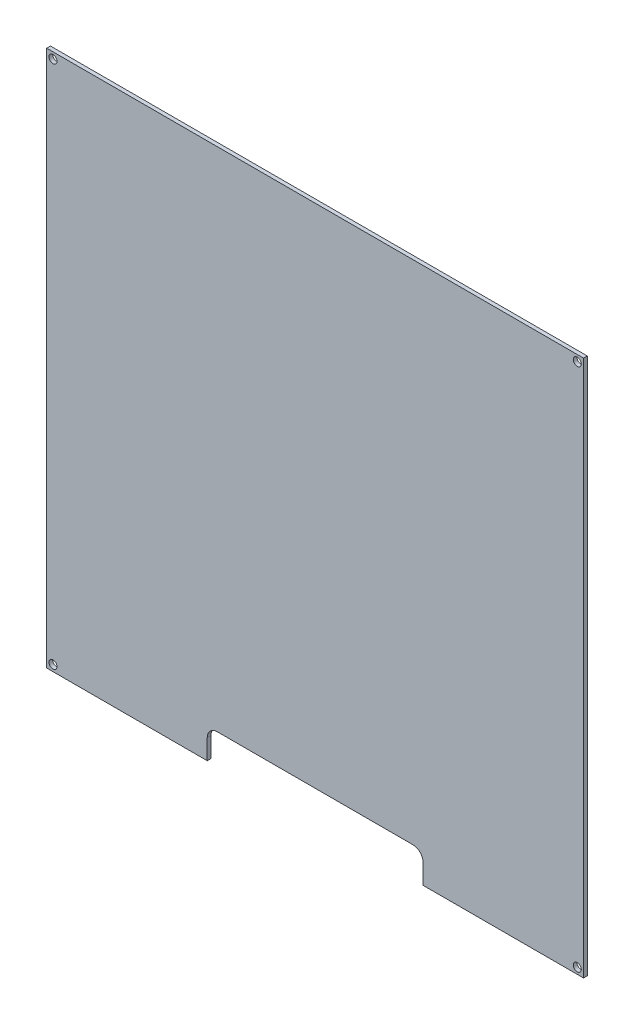
ISO-10303-21;
HEADER;
FILE_DESCRIPTION(('STEP AP214'),'2;1');
FILE_NAME('part.step','',(''),(''),'','','');
FILE_SCHEMA(('AUTOMOTIVE_DESIGN { 1 0 10303 214 1 1 1 1 }'));
ENDSEC;
DATA;
#1=APPLICATION_CONTEXT('core data for automotive mechanical design processes');
#2=APPLICATION_PROTOCOL_DEFINITION('international standard','automotive_design',2000,#1);
#3=PRODUCT_CONTEXT('',#1,'mechanical');
#4=PRODUCT('Part','Part','',(#3));
#5=PRODUCT_RELATED_PRODUCT_CATEGORY('part','',(#4));
#6=PRODUCT_DEFINITION_FORMATION('','',#4);
#7=PRODUCT_DEFINITION_CONTEXT('part definition',#1,'design');
#8=PRODUCT_DEFINITION('design','',#6,#7);
#9=PRODUCT_DEFINITION_SHAPE('','',#8);
#10=(LENGTH_UNIT() NAMED_UNIT(*) SI_UNIT(.MILLI.,.METRE.));
#11=(NAMED_UNIT(*) PLANE_ANGLE_UNIT() SI_UNIT($,.RADIAN.));
#12=(NAMED_UNIT(*) SI_UNIT($,.STERADIAN.) SOLID_ANGLE_UNIT());
#13=UNCERTAINTY_MEASURE_WITH_UNIT(LENGTH_MEASURE(1.E-05),#10,'distance_accuracy_value','');
#14=(GEOMETRIC_REPRESENTATION_CONTEXT(3) GLOBAL_UNCERTAINTY_ASSIGNED_CONTEXT((#13)) GLOBAL_UNIT_ASSIGNED_CONTEXT((#10,
#11,#12)) REPRESENTATION_CONTEXT('',''));
#15=CARTESIAN_POINT('',(0.,0.,0.));
#16=DIRECTION('',(0.,0.,1.));
#17=DIRECTION('',(1.,0.,0.));
#18=AXIS2_PLACEMENT_3D('',#15,#16,#17);
#19=CARTESIAN_POINT('',(-107.,-107.,1.5));
#20=DIRECTION('',(0.,1.,0.));
#21=DIRECTION('',(0.,0.,1.));
#22=AXIS2_PLACEMENT_3D('',#19,#20,#21);
#23=PLANE('',#22);
#24=DIRECTION('',(1.,0.,0.));
#25=VECTOR('',#24,1.);
#26=CARTESIAN_POINT('',(-107.,-107.,0.));
#27=LINE('',#26,#25);
#28=CARTESIAN_POINT('',(-107.,-107.,0.));
#29=VERTEX_POINT('',#28);
#30=CARTESIAN_POINT('',(-43.,-107.,0.));
#31=VERTEX_POINT('',#30);
#32=EDGE_CURVE('E119',#29,#31,#27,.T.);
#33=ORIENTED_EDGE('',*,*,#32,.T.);
#34=DIRECTION('',(0.,0.,1.));
#35=VECTOR('',#34,1.);
#36=CARTESIAN_POINT('',(-43.,-107.,0.));
#37=LINE('',#36,#35);
#38=CARTESIAN_POINT('',(-43.,-107.,1.5));
#39=VERTEX_POINT('',#38);
#40=EDGE_CURVE('E125',#31,#39,#37,.T.);
#41=ORIENTED_EDGE('',*,*,#40,.T.);
#42=DIRECTION('',(1.,0.,0.));
#43=VECTOR('',#42,1.);
#44=CARTESIAN_POINT('',(-107.,-107.,1.5));
#45=LINE('',#44,#43);
#46=CARTESIAN_POINT('',(-107.,-107.,1.5));
#47=VERTEX_POINT('',#46);
#48=EDGE_CURVE('E151',#47,#39,#45,.T.);
#49=ORIENTED_EDGE('',*,*,#48,.F.);
#50=DIRECTION('',(0.,0.,-1.));
#51=VECTOR('',#50,1.);
#52=CARTESIAN_POINT('',(-107.,-107.,1.5));
#53=LINE('',#52,#51);
#54=EDGE_CURVE('E137',#47,#29,#53,.T.);
#55=ORIENTED_EDGE('',*,*,#54,.T.);
#56=EDGE_LOOP('',(#33,#41,#49,#55));
#57=FACE_BOUND('',#56,.T.);
#58=ADVANCED_FACE('F39',(#57),#23,.F.);
#59=CARTESIAN_POINT('',(0.,0.,1.5));
#60=DIRECTION('',(0.,0.,-1.));
#61=DIRECTION('',(-1.,0.,0.));
#62=AXIS2_PLACEMENT_3D('',#59,#60,#61);
#63=PLANE('',#62);
#64=CARTESIAN_POINT('',(104.5,-104.5,1.5));
#65=DIRECTION('',(0.,0.,1.));
#66=DIRECTION('',(-1.,0.,0.));
#67=AXIS2_PLACEMENT_3D('',#64,#65,#66);
#68=CIRCLE('',#67,1.60000000000001);
#69=CARTESIAN_POINT('',(102.9,-104.5,1.5));
#70=VERTEX_POINT('',#69);
#71=EDGE_CURVE('E247',#70,#70,#68,.T.);
#72=ORIENTED_EDGE('',*,*,#71,.F.);
#73=EDGE_LOOP('',(#72));
#74=FACE_BOUND('',#73,.T.);
#75=CARTESIAN_POINT('',(104.5,104.5,1.5));
#76=DIRECTION('',(0.,0.,1.));
#77=DIRECTION('',(1.,0.,0.));
#78=AXIS2_PLACEMENT_3D('',#75,#76,#77);
#79=CIRCLE('',#78,1.60000000000001);
#80=CARTESIAN_POINT('',(106.1,104.5,1.5));
#81=VERTEX_POINT('',#80);
#82=EDGE_CURVE('E241',#81,#81,#79,.T.);
#83=ORIENTED_EDGE('',*,*,#82,.F.);
#84=EDGE_LOOP('',(#83));
#85=FACE_BOUND('',#84,.T.);
#86=ORIENTED_EDGE('',*,*,#48,.T.);
#87=DIRECTION('',(0.,-1.,0.));
#88=VECTOR('',#87,1.);
#89=CARTESIAN_POINT('',(-43.,-107.,1.5));
#90=LINE('',#89,#88);
#91=CARTESIAN_POINT('',(-43.,-99.,1.5));
#92=VERTEX_POINT('',#91);
#93=EDGE_CURVE('E128',#92,#39,#90,.T.);
#94=ORIENTED_EDGE('',*,*,#93,.F.);
#95=CARTESIAN_POINT('',(-39.,-99.,1.5));
#96=DIRECTION('',(0.,0.,-1.));
#97=DIRECTION('',(-1.,0.,0.));
#98=AXIS2_PLACEMENT_3D('',#95,#96,#97);
#99=CIRCLE('',#98,4.);
#100=CARTESIAN_POINT('',(-39.,-95.,1.5));
#101=VERTEX_POINT('',#100);
#102=EDGE_CURVE('E47',#92,#101,#99,.T.);
#103=ORIENTED_EDGE('',*,*,#102,.T.);
#104=DIRECTION('',(-1.,0.,0.));
#105=VECTOR('',#104,1.);
#106=CARTESIAN_POINT('',(-43.,-95.,1.5));
#107=LINE('',#106,#105);
#108=CARTESIAN_POINT('',(39.,-95.,1.5));
#109=VERTEX_POINT('',#108);
#110=EDGE_CURVE('E122',#109,#101,#107,.T.);
#111=ORIENTED_EDGE('',*,*,#110,.F.);
#112=CARTESIAN_POINT('',(39.,-99.,1.5));
#113=DIRECTION('',(0.,0.,-1.));
#114=DIRECTION('',(-1.,0.,0.));
#115=AXIS2_PLACEMENT_3D('',#112,#113,#114);
#116=CIRCLE('',#115,4.);
#117=CARTESIAN_POINT('',(43.,-99.,1.5));
#118=VERTEX_POINT('',#117);
#119=EDGE_CURVE('E168',#109,#118,#116,.T.);
#120=ORIENTED_EDGE('',*,*,#119,.T.);
#121=DIRECTION('',(0.,1.,0.));
#122=VECTOR('',#121,1.);
#123=CARTESIAN_POINT('',(43.,-107.,1.5));
#124=LINE('',#123,#122);
#125=CARTESIAN_POINT('',(43.,-107.,1.5));
#126=VERTEX_POINT('',#125);
#127=EDGE_CURVE('E180',#126,#118,#124,.T.);
#128=ORIENTED_EDGE('',*,*,#127,.F.);
#129=CARTESIAN_POINT('',(107.,-107.,1.5));
#130=VERTEX_POINT('',#129);
#131=EDGE_CURVE('E215',#126,#130,#45,.T.);
#132=ORIENTED_EDGE('',*,*,#131,.T.);
#133=DIRECTION('',(0.,1.,0.));
#134=VECTOR('',#133,1.);
#135=CARTESIAN_POINT('',(107.,-107.,1.5));
#136=LINE('',#135,#134);
#137=CARTESIAN_POINT('',(107.,107.,1.5));
#138=VERTEX_POINT('',#137);
#139=EDGE_CURVE('E138',#130,#138,#136,.T.);
#140=ORIENTED_EDGE('',*,*,#139,.T.);
#141=DIRECTION('',(-1.,0.,0.));
#142=VECTOR('',#141,1.);
#143=CARTESIAN_POINT('',(-107.,107.,1.5));
#144=LINE('',#143,#142);
#145=CARTESIAN_POINT('',(-107.,107.,1.5));
#146=VERTEX_POINT('',#145);
#147=EDGE_CURVE('E142',#138,#146,#144,.T.);
#148=ORIENTED_EDGE('',*,*,#147,.T.);
#149=DIRECTION('',(0.,-1.,0.));
#150=VECTOR('',#149,1.);
#151=CARTESIAN_POINT('',(-107.,-107.,1.5));
#152=LINE('',#151,#150);
#153=EDGE_CURVE('E219',#146,#47,#152,.T.);
#154=ORIENTED_EDGE('',*,*,#153,.T.);
#155=EDGE_LOOP('',(#86,#94,#103,#111,#120,#128,#132,#140,#148,#154));
#156=FACE_BOUND('',#155,.T.);
#157=CARTESIAN_POINT('',(-104.5,104.5,1.5));
#158=DIRECTION('',(0.,0.,1.));
#159=DIRECTION('',(1.,0.,0.));
#160=AXIS2_PLACEMENT_3D('',#157,#158,#159);
#161=CIRCLE('',#160,1.60000000000001);
#162=CARTESIAN_POINT('',(-102.9,104.5,1.5));
#163=VERTEX_POINT('',#162);
#164=EDGE_CURVE('E228',#163,#163,#161,.T.);
#165=ORIENTED_EDGE('',*,*,#164,.F.);
#166=EDGE_LOOP('',(#165));
#167=FACE_BOUND('',#166,.T.);
#168=CARTESIAN_POINT('',(-104.5,-104.5,1.5));
#169=DIRECTION('',(0.,0.,1.));
#170=DIRECTION('',(-1.,0.,0.));
#171=AXIS2_PLACEMENT_3D('',#168,#169,#170);
#172=CIRCLE('',#171,1.60000000000001);
#173=CARTESIAN_POINT('',(-106.1,-104.5,1.5));
#174=VERTEX_POINT('',#173);
#175=EDGE_CURVE('E253',#174,#174,#172,.T.);
#176=ORIENTED_EDGE('',*,*,#175,.F.);
#177=EDGE_LOOP('',(#176));
#178=FACE_BOUND('',#177,.T.);
#179=ADVANCED_FACE('F174',(#74,#85,#156,#167,#178),#63,.F.);
#180=CARTESIAN_POINT('',(0.,0.,0.));
#181=DIRECTION('',(0.,0.,-1.));
#182=DIRECTION('',(-1.,0.,0.));
#183=AXIS2_PLACEMENT_3D('',#180,#181,#182);
#184=PLANE('',#183);
#185=DIRECTION('',(-1.,0.,0.));
#186=VECTOR('',#185,1.);
#187=CARTESIAN_POINT('',(-43.,-95.,0.));
#188=LINE('',#187,#186);
#189=CARTESIAN_POINT('',(39.,-95.,0.));
#190=VERTEX_POINT('',#189);
#191=CARTESIAN_POINT('',(-39.,-95.,0.));
#192=VERTEX_POINT('',#191);
#193=EDGE_CURVE('E133',#190,#192,#188,.T.);
#194=ORIENTED_EDGE('',*,*,#193,.T.);
#195=CARTESIAN_POINT('',(-39.,-99.,0.));
#196=DIRECTION('',(0.,0.,-1.));
#197=DIRECTION('',(-1.,0.,0.));
#198=AXIS2_PLACEMENT_3D('',#195,#196,#197);
#199=CIRCLE('',#198,4.);
#200=CARTESIAN_POINT('',(-43.,-99.,0.));
#201=VERTEX_POINT('',#200);
#202=EDGE_CURVE('E11',#192,#201,#199,.F.);
#203=ORIENTED_EDGE('',*,*,#202,.T.);
#204=DIRECTION('',(0.,-1.,0.));
#205=VECTOR('',#204,1.);
#206=CARTESIAN_POINT('',(-43.,-107.,0.));
#207=LINE('',#206,#205);
#208=EDGE_CURVE('E113',#201,#31,#207,.T.);
#209=ORIENTED_EDGE('',*,*,#208,.T.);
#210=ORIENTED_EDGE('',*,*,#32,.F.);
#211=DIRECTION('',(0.,-1.,0.));
#212=VECTOR('',#211,1.);
#213=CARTESIAN_POINT('',(-107.,-107.,0.));
#214=LINE('',#213,#212);
#215=CARTESIAN_POINT('',(-107.,107.,0.));
#216=VERTEX_POINT('',#215);
#217=EDGE_CURVE('E144',#216,#29,#214,.T.);
#218=ORIENTED_EDGE('',*,*,#217,.F.);
#219=DIRECTION('',(-1.,0.,0.));
#220=VECTOR('',#219,1.);
#221=CARTESIAN_POINT('',(-107.,107.,0.));
#222=LINE('',#221,#220);
#223=CARTESIAN_POINT('',(107.,107.,0.));
#224=VERTEX_POINT('',#223);
#225=EDGE_CURVE('E227',#224,#216,#222,.T.);
#226=ORIENTED_EDGE('',*,*,#225,.F.);
#227=DIRECTION('',(0.,1.,0.));
#228=VECTOR('',#227,1.);
#229=CARTESIAN_POINT('',(107.,-107.,0.));
#230=LINE('',#229,#228);
#231=CARTESIAN_POINT('',(107.,-107.,0.));
#232=VERTEX_POINT('',#231);
#233=EDGE_CURVE('E225',#232,#224,#230,.T.);
#234=ORIENTED_EDGE('',*,*,#233,.F.);
#235=CARTESIAN_POINT('',(43.,-107.,0.));
#236=VERTEX_POINT('',#235);
#237=EDGE_CURVE('E139',#236,#232,#27,.T.);
#238=ORIENTED_EDGE('',*,*,#237,.F.);
#239=DIRECTION('',(0.,1.,0.));
#240=VECTOR('',#239,1.);
#241=CARTESIAN_POINT('',(43.,-107.,0.));
#242=LINE('',#241,#240);
#243=CARTESIAN_POINT('',(43.,-99.,0.));
#244=VERTEX_POINT('',#243);
#245=EDGE_CURVE('E121',#236,#244,#242,.T.);
#246=ORIENTED_EDGE('',*,*,#245,.T.);
#247=CARTESIAN_POINT('',(39.,-99.,0.));
#248=DIRECTION('',(0.,0.,-1.));
#249=DIRECTION('',(-1.,0.,0.));
#250=AXIS2_PLACEMENT_3D('',#247,#248,#249);
#251=CIRCLE('',#250,4.);
#252=EDGE_CURVE('E170',#244,#190,#251,.F.);
#253=ORIENTED_EDGE('',*,*,#252,.T.);
#254=EDGE_LOOP('',(#194,#203,#209,#210,#218,#226,#234,#238,#246,#253));
#255=FACE_BOUND('',#254,.T.);
#256=CARTESIAN_POINT('',(104.5,-104.5,0.));
#257=DIRECTION('',(0.,0.,1.));
#258=DIRECTION('',(-1.,0.,0.));
#259=AXIS2_PLACEMENT_3D('',#256,#257,#258);
#260=CIRCLE('',#259,1.60000000000001);
#261=CARTESIAN_POINT('',(102.9,-104.5,0.));
#262=VERTEX_POINT('',#261);
#263=EDGE_CURVE('E250',#262,#262,#260,.T.);
#264=ORIENTED_EDGE('',*,*,#263,.T.);
#265=EDGE_LOOP('',(#264));
#266=FACE_BOUND('',#265,.T.);
#267=CARTESIAN_POINT('',(104.5,104.5,0.));
#268=DIRECTION('',(0.,0.,1.));
#269=DIRECTION('',(1.,0.,0.));
#270=AXIS2_PLACEMENT_3D('',#267,#268,#269);
#271=CIRCLE('',#270,1.60000000000001);
#272=CARTESIAN_POINT('',(106.1,104.5,0.));
#273=VERTEX_POINT('',#272);
#274=EDGE_CURVE('E244',#273,#273,#271,.T.);
#275=ORIENTED_EDGE('',*,*,#274,.T.);
#276=EDGE_LOOP('',(#275));
#277=FACE_BOUND('',#276,.T.);
#278=CARTESIAN_POINT('',(-104.5,104.5,0.));
#279=DIRECTION('',(0.,0.,1.));
#280=DIRECTION('',(1.,0.,0.));
#281=AXIS2_PLACEMENT_3D('',#278,#279,#280);
#282=CIRCLE('',#281,1.60000000000001);
#283=CARTESIAN_POINT('',(-102.9,104.5,0.));
#284=VERTEX_POINT('',#283);
#285=EDGE_CURVE('E238',#284,#284,#282,.T.);
#286=ORIENTED_EDGE('',*,*,#285,.T.);
#287=EDGE_LOOP('',(#286));
#288=FACE_BOUND('',#287,.T.);
#289=CARTESIAN_POINT('',(-104.5,-104.5,0.));
#290=DIRECTION('',(0.,0.,1.));
#291=DIRECTION('',(-1.,0.,0.));
#292=AXIS2_PLACEMENT_3D('',#289,#290,#291);
#293=CIRCLE('',#292,1.60000000000001);
#294=CARTESIAN_POINT('',(-106.1,-104.5,0.));
#295=VERTEX_POINT('',#294);
#296=EDGE_CURVE('E256',#295,#295,#293,.T.);
#297=ORIENTED_EDGE('',*,*,#296,.T.);
#298=EDGE_LOOP('',(#297));
#299=FACE_BOUND('',#298,.T.);
#300=ADVANCED_FACE('F115',(#255,#266,#277,#288,#299),#184,.T.);
#301=CARTESIAN_POINT('',(107.,-107.,1.5));
#302=DIRECTION('',(-1.,0.,0.));
#303=DIRECTION('',(0.,0.,1.));
#304=AXIS2_PLACEMENT_3D('',#301,#302,#303);
#305=PLANE('',#304);
#306=ORIENTED_EDGE('',*,*,#233,.T.);
#307=DIRECTION('',(0.,0.,-1.));
#308=VECTOR('',#307,1.);
#309=CARTESIAN_POINT('',(107.,107.,1.5));
#310=LINE('',#309,#308);
#311=EDGE_CURVE('E156',#138,#224,#310,.T.);
#312=ORIENTED_EDGE('',*,*,#311,.F.);
#313=ORIENTED_EDGE('',*,*,#139,.F.);
#314=DIRECTION('',(0.,0.,-1.));
#315=VECTOR('',#314,1.);
#316=CARTESIAN_POINT('',(107.,-107.,1.5));
#317=LINE('',#316,#315);
#318=EDGE_CURVE('E148',#130,#232,#317,.T.);
#319=ORIENTED_EDGE('',*,*,#318,.T.);
#320=EDGE_LOOP('',(#306,#312,#313,#319));
#321=FACE_BOUND('',#320,.T.);
#322=ADVANCED_FACE('F236',(#321),#305,.F.);
#323=CARTESIAN_POINT('',(-107.,107.,1.5));
#324=DIRECTION('',(0.,-1.,0.));
#325=DIRECTION('',(0.,0.,-1.));
#326=AXIS2_PLACEMENT_3D('',#323,#324,#325);
#327=PLANE('',#326);
#328=ORIENTED_EDGE('',*,*,#225,.T.);
#329=DIRECTION('',(0.,0.,-1.));
#330=VECTOR('',#329,1.);
#331=CARTESIAN_POINT('',(-107.,107.,1.5));
#332=LINE('',#331,#330);
#333=EDGE_CURVE('E153',#146,#216,#332,.T.);
#334=ORIENTED_EDGE('',*,*,#333,.F.);
#335=ORIENTED_EDGE('',*,*,#147,.F.);
#336=ORIENTED_EDGE('',*,*,#311,.T.);
#337=EDGE_LOOP('',(#328,#334,#335,#336));
#338=FACE_BOUND('',#337,.T.);
#339=ADVANCED_FACE('F210',(#338),#327,.F.);
#340=CARTESIAN_POINT('',(-107.,-107.,1.5));
#341=DIRECTION('',(1.,0.,0.));
#342=DIRECTION('',(0.,0.,-1.));
#343=AXIS2_PLACEMENT_3D('',#340,#341,#342);
#344=PLANE('',#343);
#345=ORIENTED_EDGE('',*,*,#217,.T.);
#346=ORIENTED_EDGE('',*,*,#54,.F.);
#347=ORIENTED_EDGE('',*,*,#153,.F.);
#348=ORIENTED_EDGE('',*,*,#333,.T.);
#349=EDGE_LOOP('',(#345,#346,#347,#348));
#350=FACE_BOUND('',#349,.T.);
#351=ADVANCED_FACE('F201',(#350),#344,.F.);
#352=ORIENTED_EDGE('',*,*,#131,.F.);
#353=DIRECTION('',(0.,0.,1.));
#354=VECTOR('',#353,1.);
#355=CARTESIAN_POINT('',(43.,-107.,0.));
#356=LINE('',#355,#354);
#357=EDGE_CURVE('E132',#236,#126,#356,.T.);
#358=ORIENTED_EDGE('',*,*,#357,.F.);
#359=ORIENTED_EDGE('',*,*,#237,.T.);
#360=ORIENTED_EDGE('',*,*,#318,.F.);
#361=EDGE_LOOP('',(#352,#358,#359,#360));
#362=FACE_BOUND('',#361,.T.);
#363=ADVANCED_FACE('F191',(#362),#23,.F.);
#364=CARTESIAN_POINT('',(-104.5,104.5,1.5));
#365=DIRECTION('',(0.,0.,-1.));
#366=DIRECTION('',(-1.,0.,0.));
#367=AXIS2_PLACEMENT_3D('',#364,#365,#366);
#368=CYLINDRICAL_SURFACE('',#367,1.60000000000001);
#369=ORIENTED_EDGE('',*,*,#164,.T.);
#370=EDGE_LOOP('',(#369));
#371=FACE_BOUND('',#370,.T.);
#372=ORIENTED_EDGE('',*,*,#285,.F.);
#373=EDGE_LOOP('',(#372));
#374=FACE_BOUND('',#373,.T.);
#375=ADVANCED_FACE('F200',(#371,#374),#368,.F.);
#376=CARTESIAN_POINT('',(104.5,104.5,1.5));
#377=DIRECTION('',(0.,0.,-1.));
#378=DIRECTION('',(-1.,0.,0.));
#379=AXIS2_PLACEMENT_3D('',#376,#377,#378);
#380=CYLINDRICAL_SURFACE('',#379,1.60000000000001);
#381=ORIENTED_EDGE('',*,*,#82,.T.);
#382=EDGE_LOOP('',(#381));
#383=FACE_BOUND('',#382,.T.);
#384=ORIENTED_EDGE('',*,*,#274,.F.);
#385=EDGE_LOOP('',(#384));
#386=FACE_BOUND('',#385,.T.);
#387=ADVANCED_FACE('F207',(#383,#386),#380,.F.);
#388=CARTESIAN_POINT('',(104.5,-104.5,1.5));
#389=DIRECTION('',(0.,0.,-1.));
#390=DIRECTION('',(-1.,0.,0.));
#391=AXIS2_PLACEMENT_3D('',#388,#389,#390);
#392=CYLINDRICAL_SURFACE('',#391,1.60000000000001);
#393=ORIENTED_EDGE('',*,*,#71,.T.);
#394=EDGE_LOOP('',(#393));
#395=FACE_BOUND('',#394,.T.);
#396=ORIENTED_EDGE('',*,*,#263,.F.);
#397=EDGE_LOOP('',(#396));
#398=FACE_BOUND('',#397,.T.);
#399=ADVANCED_FACE('F282',(#395,#398),#392,.F.);
#400=CARTESIAN_POINT('',(-104.5,-104.5,1.5));
#401=DIRECTION('',(0.,0.,-1.));
#402=DIRECTION('',(-1.,0.,0.));
#403=AXIS2_PLACEMENT_3D('',#400,#401,#402);
#404=CYLINDRICAL_SURFACE('',#403,1.60000000000001);
#405=ORIENTED_EDGE('',*,*,#175,.T.);
#406=EDGE_LOOP('',(#405));
#407=FACE_BOUND('',#406,.T.);
#408=ORIENTED_EDGE('',*,*,#296,.F.);
#409=EDGE_LOOP('',(#408));
#410=FACE_BOUND('',#409,.T.);
#411=ADVANCED_FACE('F279',(#407,#410),#404,.F.);
#412=CARTESIAN_POINT('',(-43.,-107.,0.));
#413=DIRECTION('',(-1.,0.,0.));
#414=DIRECTION('',(0.,-1.,0.));
#415=AXIS2_PLACEMENT_3D('',#412,#413,#414);
#416=PLANE('',#415);
#417=ORIENTED_EDGE('',*,*,#208,.F.);
#418=DIRECTION('',(0.,0.,1.));
#419=VECTOR('',#418,1.);
#420=CARTESIAN_POINT('',(-43.,-99.,1.5));
#421=LINE('',#420,#419);
#422=EDGE_CURVE('E166',#201,#92,#421,.T.);
#423=ORIENTED_EDGE('',*,*,#422,.T.);
#424=ORIENTED_EDGE('',*,*,#93,.T.);
#425=ORIENTED_EDGE('',*,*,#40,.F.);
#426=EDGE_LOOP('',(#417,#423,#424,#425));
#427=FACE_BOUND('',#426,.T.);
#428=ADVANCED_FACE('F126',(#427),#416,.F.);
#429=CARTESIAN_POINT('',(-43.,-95.,0.));
#430=DIRECTION('',(0.,1.,0.));
#431=DIRECTION('',(0.,0.,1.));
#432=AXIS2_PLACEMENT_3D('',#429,#430,#431);
#433=PLANE('',#432);
#434=ORIENTED_EDGE('',*,*,#193,.F.);
#435=DIRECTION('',(0.,0.,1.));
#436=VECTOR('',#435,1.);
#437=CARTESIAN_POINT('',(39.,-95.,1.5));
#438=LINE('',#437,#436);
#439=EDGE_CURVE('E161',#190,#109,#438,.T.);
#440=ORIENTED_EDGE('',*,*,#439,.T.);
#441=ORIENTED_EDGE('',*,*,#110,.T.);
#442=DIRECTION('',(0.,0.,1.));
#443=VECTOR('',#442,1.);
#444=CARTESIAN_POINT('',(-39.,-95.,0.));
#445=LINE('',#444,#443);
#446=EDGE_CURVE('E159',#101,#192,#445,.F.);
#447=ORIENTED_EDGE('',*,*,#446,.T.);
#448=EDGE_LOOP('',(#434,#440,#441,#447));
#449=FACE_BOUND('',#448,.T.);
#450=ADVANCED_FACE('F178',(#449),#433,.F.);
#451=CARTESIAN_POINT('',(43.,-107.,0.));
#452=DIRECTION('',(1.,0.,0.));
#453=DIRECTION('',(0.,1.,0.));
#454=AXIS2_PLACEMENT_3D('',#451,#452,#453);
#455=PLANE('',#454);
#456=ORIENTED_EDGE('',*,*,#127,.T.);
#457=DIRECTION('',(0.,0.,1.));
#458=VECTOR('',#457,1.);
#459=CARTESIAN_POINT('',(43.,-99.,0.));
#460=LINE('',#459,#458);
#461=EDGE_CURVE('E164',#118,#244,#460,.F.);
#462=ORIENTED_EDGE('',*,*,#461,.T.);
#463=ORIENTED_EDGE('',*,*,#245,.F.);
#464=ORIENTED_EDGE('',*,*,#357,.T.);
#465=EDGE_LOOP('',(#456,#462,#463,#464));
#466=FACE_BOUND('',#465,.T.);
#467=ADVANCED_FACE('F187',(#466),#455,.F.);
#468=CARTESIAN_POINT('',(39.,-99.,0.));
#469=DIRECTION('',(0.,0.,-1.));
#470=DIRECTION('',(-1.,0.,0.));
#471=AXIS2_PLACEMENT_3D('',#468,#469,#470);
#472=CYLINDRICAL_SURFACE('',#471,4.);
#473=ORIENTED_EDGE('',*,*,#252,.F.);
#474=ORIENTED_EDGE('',*,*,#461,.F.);
#475=ORIENTED_EDGE('',*,*,#119,.F.);
#476=ORIENTED_EDGE('',*,*,#439,.F.);
#477=EDGE_LOOP('',(#473,#474,#475,#476));
#478=FACE_BOUND('',#477,.T.);
#479=ADVANCED_FACE('F183',(#478),#472,.F.);
#480=CARTESIAN_POINT('',(-39.,-99.,0.));
#481=DIRECTION('',(0.,0.,-1.));
#482=DIRECTION('',(-1.,0.,0.));
#483=AXIS2_PLACEMENT_3D('',#480,#481,#482);
#484=CYLINDRICAL_SURFACE('',#483,4.);
#485=ORIENTED_EDGE('',*,*,#202,.F.);
#486=ORIENTED_EDGE('',*,*,#446,.F.);
#487=ORIENTED_EDGE('',*,*,#102,.F.);
#488=ORIENTED_EDGE('',*,*,#422,.F.);
#489=EDGE_LOOP('',(#485,#486,#487,#488));
#490=FACE_BOUND('',#489,.T.);
#491=ADVANCED_FACE('F41',(#490),#484,.F.);
#492=CLOSED_SHELL('',(#58,#179,#300,#322,#339,#351,#363,#375,#387,#399,#411,#428,#450,#467,#479,#491));
#493=MANIFOLD_SOLID_BREP('B2',#492);
#494=ADVANCED_BREP_SHAPE_REPRESENTATION('',(#18,#493),#14);
#495=SHAPE_DEFINITION_REPRESENTATION(#9,#494);
ENDSEC;
END-ISO-10303-21;
